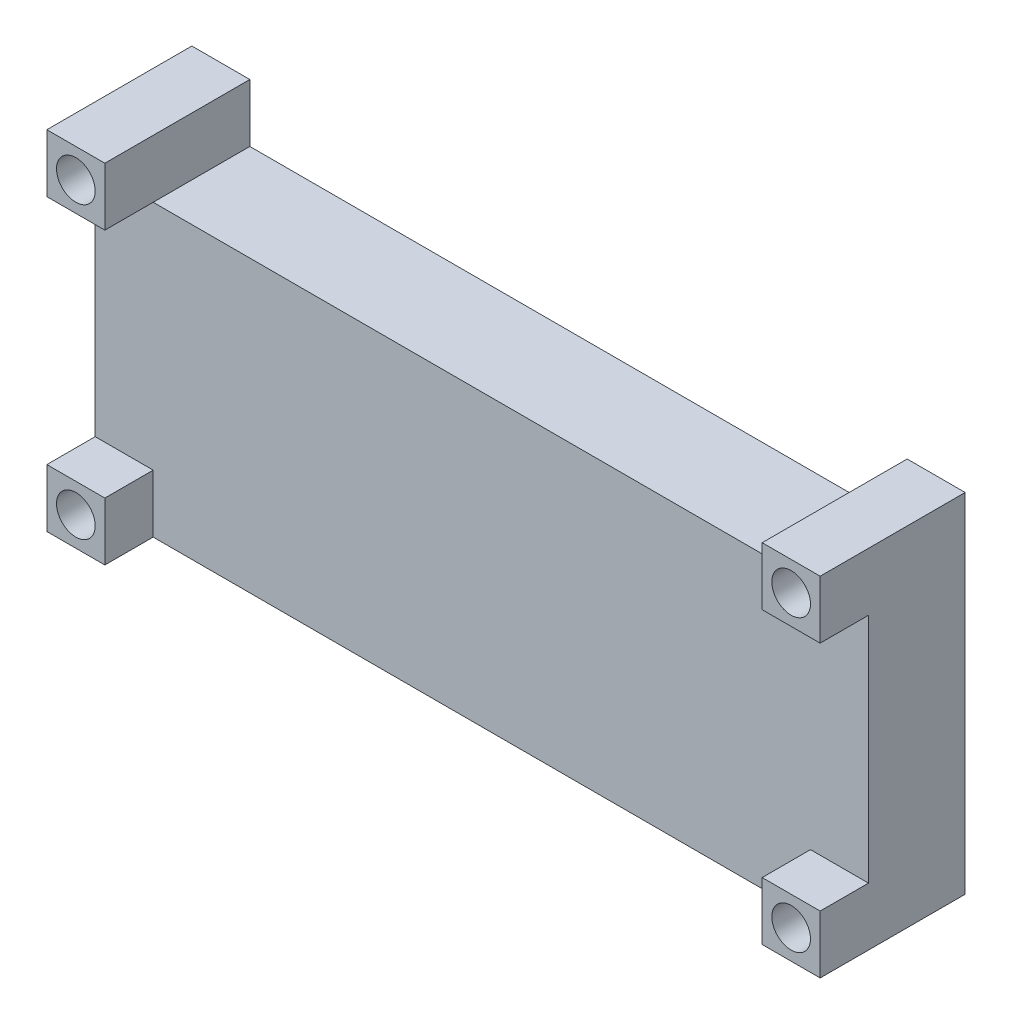
ISO-10303-21;
HEADER;
FILE_DESCRIPTION(('STEP AP214'),'2;1');
FILE_NAME('part.step','',(''),(''),'','','');
FILE_SCHEMA(('AUTOMOTIVE_DESIGN { 1 0 10303 214 1 1 1 1 }'));
ENDSEC;
DATA;
#1=APPLICATION_CONTEXT('core data for automotive mechanical design processes');
#2=APPLICATION_PROTOCOL_DEFINITION('international standard','automotive_design',2000,#1);
#3=PRODUCT_CONTEXT('',#1,'mechanical');
#4=PRODUCT('Part','Part','',(#3));
#5=PRODUCT_RELATED_PRODUCT_CATEGORY('part','',(#4));
#6=PRODUCT_DEFINITION_FORMATION('','',#4);
#7=PRODUCT_DEFINITION_CONTEXT('part definition',#1,'design');
#8=PRODUCT_DEFINITION('design','',#6,#7);
#9=PRODUCT_DEFINITION_SHAPE('','',#8);
#10=(LENGTH_UNIT() NAMED_UNIT(*) SI_UNIT(.MILLI.,.METRE.));
#11=(NAMED_UNIT(*) PLANE_ANGLE_UNIT() SI_UNIT($,.RADIAN.));
#12=(NAMED_UNIT(*) SI_UNIT($,.STERADIAN.) SOLID_ANGLE_UNIT());
#13=UNCERTAINTY_MEASURE_WITH_UNIT(LENGTH_MEASURE(1.E-05),#10,'distance_accuracy_value','');
#14=(GEOMETRIC_REPRESENTATION_CONTEXT(3) GLOBAL_UNCERTAINTY_ASSIGNED_CONTEXT((#13)) GLOBAL_UNIT_ASSIGNED_CONTEXT((#10,
#11,#12)) REPRESENTATION_CONTEXT('',''));
#15=CARTESIAN_POINT('',(0.,0.,0.));
#16=DIRECTION('',(0.,0.,1.));
#17=DIRECTION('',(1.,0.,0.));
#18=AXIS2_PLACEMENT_3D('',#15,#16,#17);
#19=CARTESIAN_POINT('',(0.,0.,10.));
#20=DIRECTION('',(1.,0.,0.));
#21=DIRECTION('',(0.,0.,-1.));
#22=AXIS2_PLACEMENT_3D('',#19,#20,#21);
#23=PLANE('',#22);
#24=DIRECTION('',(0.,-1.,0.));
#25=VECTOR('',#24,1.);
#26=CARTESIAN_POINT('',(0.,0.,0.));
#27=LINE('',#26,#25);
#28=CARTESIAN_POINT('',(0.,36.,0.));
#29=VERTEX_POINT('',#28);
#30=CARTESIAN_POINT('',(0.,0.,0.));
#31=VERTEX_POINT('',#30);
#32=EDGE_CURVE('E263',#29,#31,#27,.T.);
#33=ORIENTED_EDGE('',*,*,#32,.T.);
#34=DIRECTION('',(0.,0.,-1.));
#35=VECTOR('',#34,1.);
#36=CARTESIAN_POINT('',(0.,0.,10.));
#37=LINE('',#36,#35);
#38=CARTESIAN_POINT('',(0.,0.,15.));
#39=VERTEX_POINT('',#38);
#40=EDGE_CURVE('E11',#39,#31,#37,.T.);
#41=ORIENTED_EDGE('',*,*,#40,.F.);
#42=DIRECTION('',(0.,-1.,0.));
#43=VECTOR('',#42,1.);
#44=CARTESIAN_POINT('',(0.,6.,15.));
#45=LINE('',#44,#43);
#46=CARTESIAN_POINT('',(0.,6.,15.));
#47=VERTEX_POINT('',#46);
#48=EDGE_CURVE('E214',#47,#39,#45,.T.);
#49=ORIENTED_EDGE('',*,*,#48,.F.);
#50=DIRECTION('',(0.,0.,-1.));
#51=VECTOR('',#50,1.);
#52=CARTESIAN_POINT('',(0.,6.,15.));
#53=LINE('',#52,#51);
#54=CARTESIAN_POINT('',(0.,6.,10.));
#55=VERTEX_POINT('',#54);
#56=EDGE_CURVE('E224',#47,#55,#53,.T.);
#57=ORIENTED_EDGE('',*,*,#56,.T.);
#58=DIRECTION('',(0.,-1.,0.));
#59=VECTOR('',#58,1.);
#60=CARTESIAN_POINT('',(0.,0.,10.));
#61=LINE('',#60,#59);
#62=CARTESIAN_POINT('',(0.,30.,10.));
#63=VERTEX_POINT('',#62);
#64=EDGE_CURVE('E264',#63,#55,#61,.T.);
#65=ORIENTED_EDGE('',*,*,#64,.F.);
#66=DIRECTION('',(0.,0.,-1.));
#67=VECTOR('',#66,1.);
#68=CARTESIAN_POINT('',(0.,30.,15.));
#69=LINE('',#68,#67);
#70=CARTESIAN_POINT('',(0.,30.,15.));
#71=VERTEX_POINT('',#70);
#72=EDGE_CURVE('E260',#71,#63,#69,.T.);
#73=ORIENTED_EDGE('',*,*,#72,.F.);
#74=DIRECTION('',(0.,-1.,0.));
#75=VECTOR('',#74,1.);
#76=CARTESIAN_POINT('',(0.,36.,15.));
#77=LINE('',#76,#75);
#78=CARTESIAN_POINT('',(0.,36.,15.));
#79=VERTEX_POINT('',#78);
#80=EDGE_CURVE('E244',#79,#71,#77,.T.);
#81=ORIENTED_EDGE('',*,*,#80,.F.);
#82=DIRECTION('',(0.,0.,-1.));
#83=VECTOR('',#82,1.);
#84=CARTESIAN_POINT('',(0.,36.,10.));
#85=LINE('',#84,#83);
#86=EDGE_CURVE('E273',#79,#29,#85,.T.);
#87=ORIENTED_EDGE('',*,*,#86,.T.);
#88=EDGE_LOOP('',(#33,#41,#49,#57,#65,#73,#81,#87));
#89=FACE_BOUND('',#88,.T.);
#90=ADVANCED_FACE('F41',(#89),#23,.F.);
#91=CARTESIAN_POINT('',(0.,0.,10.));
#92=DIRECTION('',(0.,1.,0.));
#93=DIRECTION('',(0.,0.,1.));
#94=AXIS2_PLACEMENT_3D('',#91,#92,#93);
#95=PLANE('',#94);
#96=DIRECTION('',(1.,0.,0.));
#97=VECTOR('',#96,1.);
#98=CARTESIAN_POINT('',(0.,0.,0.));
#99=LINE('',#98,#97);
#100=CARTESIAN_POINT('',(80.,0.,0.));
#101=VERTEX_POINT('',#100);
#102=EDGE_CURVE('E276',#31,#101,#99,.T.);
#103=ORIENTED_EDGE('',*,*,#102,.T.);
#104=DIRECTION('',(0.,0.,-1.));
#105=VECTOR('',#104,1.);
#106=CARTESIAN_POINT('',(80.,0.,10.));
#107=LINE('',#106,#105);
#108=CARTESIAN_POINT('',(80.,0.,15.));
#109=VERTEX_POINT('',#108);
#110=EDGE_CURVE('E48',#109,#101,#107,.T.);
#111=ORIENTED_EDGE('',*,*,#110,.F.);
#112=DIRECTION('',(1.,0.,0.));
#113=VECTOR('',#112,1.);
#114=CARTESIAN_POINT('',(74.,0.,15.));
#115=LINE('',#114,#113);
#116=CARTESIAN_POINT('',(74.,0.,15.));
#117=VERTEX_POINT('',#116);
#118=EDGE_CURVE('E157',#117,#109,#115,.T.);
#119=ORIENTED_EDGE('',*,*,#118,.F.);
#120=DIRECTION('',(0.,0.,-1.));
#121=VECTOR('',#120,1.);
#122=CARTESIAN_POINT('',(74.,0.,15.));
#123=LINE('',#122,#121);
#124=CARTESIAN_POINT('',(74.,0.,10.));
#125=VERTEX_POINT('',#124);
#126=EDGE_CURVE('E161',#117,#125,#123,.T.);
#127=ORIENTED_EDGE('',*,*,#126,.T.);
#128=DIRECTION('',(1.,0.,0.));
#129=VECTOR('',#128,1.);
#130=CARTESIAN_POINT('',(0.,0.,10.));
#131=LINE('',#130,#129);
#132=CARTESIAN_POINT('',(6.,0.,10.));
#133=VERTEX_POINT('',#132);
#134=EDGE_CURVE('E61',#133,#125,#131,.T.);
#135=ORIENTED_EDGE('',*,*,#134,.F.);
#136=DIRECTION('',(0.,0.,-1.));
#137=VECTOR('',#136,1.);
#138=CARTESIAN_POINT('',(6.,0.,15.));
#139=LINE('',#138,#137);
#140=CARTESIAN_POINT('',(6.,0.,15.));
#141=VERTEX_POINT('',#140);
#142=EDGE_CURVE('E234',#141,#133,#139,.T.);
#143=ORIENTED_EDGE('',*,*,#142,.F.);
#144=DIRECTION('',(1.,0.,0.));
#145=VECTOR('',#144,1.);
#146=CARTESIAN_POINT('',(0.,0.,15.));
#147=LINE('',#146,#145);
#148=EDGE_CURVE('E217',#39,#141,#147,.T.);
#149=ORIENTED_EDGE('',*,*,#148,.F.);
#150=ORIENTED_EDGE('',*,*,#40,.T.);
#151=EDGE_LOOP('',(#103,#111,#119,#127,#135,#143,#149,#150));
#152=FACE_BOUND('',#151,.T.);
#153=ADVANCED_FACE('F159',(#152),#95,.F.);
#154=CARTESIAN_POINT('',(80.,0.,10.));
#155=DIRECTION('',(-1.,0.,0.));
#156=DIRECTION('',(0.,0.,1.));
#157=AXIS2_PLACEMENT_3D('',#154,#155,#156);
#158=PLANE('',#157);
#159=DIRECTION('',(0.,1.,0.));
#160=VECTOR('',#159,1.);
#161=CARTESIAN_POINT('',(80.,0.,0.));
#162=LINE('',#161,#160);
#163=CARTESIAN_POINT('',(80.,36.,0.));
#164=VERTEX_POINT('',#163);
#165=EDGE_CURVE('E278',#101,#164,#162,.T.);
#166=ORIENTED_EDGE('',*,*,#165,.T.);
#167=DIRECTION('',(0.,0.,-1.));
#168=VECTOR('',#167,1.);
#169=CARTESIAN_POINT('',(80.,36.,10.));
#170=LINE('',#169,#168);
#171=CARTESIAN_POINT('',(80.,36.,15.));
#172=VERTEX_POINT('',#171);
#173=EDGE_CURVE('E303',#172,#164,#170,.T.);
#174=ORIENTED_EDGE('',*,*,#173,.F.);
#175=DIRECTION('',(0.,1.,0.));
#176=VECTOR('',#175,1.);
#177=CARTESIAN_POINT('',(80.,36.,15.));
#178=LINE('',#177,#176);
#179=CARTESIAN_POINT('',(80.,30.,15.));
#180=VERTEX_POINT('',#179);
#181=EDGE_CURVE('E196',#180,#172,#178,.T.);
#182=ORIENTED_EDGE('',*,*,#181,.F.);
#183=DIRECTION('',(0.,0.,-1.));
#184=VECTOR('',#183,1.);
#185=CARTESIAN_POINT('',(80.,30.,15.));
#186=LINE('',#185,#184);
#187=CARTESIAN_POINT('',(80.,30.,10.));
#188=VERTEX_POINT('',#187);
#189=EDGE_CURVE('E202',#180,#188,#186,.T.);
#190=ORIENTED_EDGE('',*,*,#189,.T.);
#191=DIRECTION('',(0.,1.,0.));
#192=VECTOR('',#191,1.);
#193=CARTESIAN_POINT('',(80.,0.,10.));
#194=LINE('',#193,#192);
#195=CARTESIAN_POINT('',(80.,6.,10.));
#196=VERTEX_POINT('',#195);
#197=EDGE_CURVE('E268',#196,#188,#194,.T.);
#198=ORIENTED_EDGE('',*,*,#197,.F.);
#199=DIRECTION('',(0.,0.,-1.));
#200=VECTOR('',#199,1.);
#201=CARTESIAN_POINT('',(80.,6.,15.));
#202=LINE('',#201,#200);
#203=CARTESIAN_POINT('',(80.,6.,15.));
#204=VERTEX_POINT('',#203);
#205=EDGE_CURVE('E181',#204,#196,#202,.T.);
#206=ORIENTED_EDGE('',*,*,#205,.F.);
#207=DIRECTION('',(0.,1.,0.));
#208=VECTOR('',#207,1.);
#209=CARTESIAN_POINT('',(80.,6.,15.));
#210=LINE('',#209,#208);
#211=EDGE_CURVE('E166',#109,#204,#210,.T.);
#212=ORIENTED_EDGE('',*,*,#211,.F.);
#213=ORIENTED_EDGE('',*,*,#110,.T.);
#214=EDGE_LOOP('',(#166,#174,#182,#190,#198,#206,#212,#213));
#215=FACE_BOUND('',#214,.T.);
#216=ADVANCED_FACE('F307',(#215),#158,.F.);
#217=CARTESIAN_POINT('',(74.,36.,10.));
#218=DIRECTION('',(0.,-1.,0.));
#219=DIRECTION('',(0.,0.,-1.));
#220=AXIS2_PLACEMENT_3D('',#217,#218,#219);
#221=PLANE('',#220);
#222=DIRECTION('',(-1.,0.,0.));
#223=VECTOR('',#222,1.);
#224=CARTESIAN_POINT('',(74.,36.,0.));
#225=LINE('',#224,#223);
#226=CARTESIAN_POINT('',(74.,36.,0.));
#227=VERTEX_POINT('',#226);
#228=EDGE_CURVE('E280',#164,#227,#225,.T.);
#229=ORIENTED_EDGE('',*,*,#228,.T.);
#230=DIRECTION('',(0.,0.,-1.));
#231=VECTOR('',#230,1.);
#232=CARTESIAN_POINT('',(74.,36.,10.));
#233=LINE('',#232,#231);
#234=CARTESIAN_POINT('',(74.,36.,15.));
#235=VERTEX_POINT('',#234);
#236=EDGE_CURVE('E300',#235,#227,#233,.T.);
#237=ORIENTED_EDGE('',*,*,#236,.F.);
#238=DIRECTION('',(-1.,0.,0.));
#239=VECTOR('',#238,1.);
#240=CARTESIAN_POINT('',(74.,36.,15.));
#241=LINE('',#240,#239);
#242=EDGE_CURVE('E199',#172,#235,#241,.T.);
#243=ORIENTED_EDGE('',*,*,#242,.F.);
#244=ORIENTED_EDGE('',*,*,#173,.T.);
#245=EDGE_LOOP('',(#229,#237,#243,#244));
#246=FACE_BOUND('',#245,.T.);
#247=ADVANCED_FACE('F316',(#246),#221,.F.);
#248=CARTESIAN_POINT('',(74.,30.,10.));
#249=DIRECTION('',(1.,0.,0.));
#250=DIRECTION('',(0.,0.,-1.));
#251=AXIS2_PLACEMENT_3D('',#248,#249,#250);
#252=PLANE('',#251);
#253=DIRECTION('',(0.,-1.,0.));
#254=VECTOR('',#253,1.);
#255=CARTESIAN_POINT('',(74.,30.,0.));
#256=LINE('',#255,#254);
#257=CARTESIAN_POINT('',(74.,30.,0.));
#258=VERTEX_POINT('',#257);
#259=EDGE_CURVE('E282',#227,#258,#256,.T.);
#260=ORIENTED_EDGE('',*,*,#259,.T.);
#261=DIRECTION('',(0.,0.,-1.));
#262=VECTOR('',#261,1.);
#263=CARTESIAN_POINT('',(74.,30.,10.));
#264=LINE('',#263,#262);
#265=CARTESIAN_POINT('',(74.,30.,10.));
#266=VERTEX_POINT('',#265);
#267=EDGE_CURVE('E297',#266,#258,#264,.T.);
#268=ORIENTED_EDGE('',*,*,#267,.F.);
#269=DIRECTION('',(0.,0.,-1.));
#270=VECTOR('',#269,1.);
#271=CARTESIAN_POINT('',(74.,30.,15.));
#272=LINE('',#271,#270);
#273=CARTESIAN_POINT('',(74.,30.,15.));
#274=VERTEX_POINT('',#273);
#275=EDGE_CURVE('E207',#274,#266,#272,.T.);
#276=ORIENTED_EDGE('',*,*,#275,.F.);
#277=DIRECTION('',(0.,-1.,0.));
#278=VECTOR('',#277,1.);
#279=CARTESIAN_POINT('',(74.,36.,15.));
#280=LINE('',#279,#278);
#281=EDGE_CURVE('E191',#235,#274,#280,.T.);
#282=ORIENTED_EDGE('',*,*,#281,.F.);
#283=ORIENTED_EDGE('',*,*,#236,.T.);
#284=EDGE_LOOP('',(#260,#268,#276,#282,#283));
#285=FACE_BOUND('',#284,.T.);
#286=ADVANCED_FACE('F320',(#285),#252,.F.);
#287=CARTESIAN_POINT('',(6.,30.,10.));
#288=DIRECTION('',(0.,-1.,0.));
#289=DIRECTION('',(0.,0.,-1.));
#290=AXIS2_PLACEMENT_3D('',#287,#288,#289);
#291=PLANE('',#290);
#292=DIRECTION('',(-1.,0.,0.));
#293=VECTOR('',#292,1.);
#294=CARTESIAN_POINT('',(6.,30.,0.));
#295=LINE('',#294,#293);
#296=CARTESIAN_POINT('',(6.,30.,0.));
#297=VERTEX_POINT('',#296);
#298=EDGE_CURVE('E284',#258,#297,#295,.T.);
#299=ORIENTED_EDGE('',*,*,#298,.T.);
#300=DIRECTION('',(0.,0.,-1.));
#301=VECTOR('',#300,1.);
#302=CARTESIAN_POINT('',(6.,30.,10.));
#303=LINE('',#302,#301);
#304=CARTESIAN_POINT('',(6.,30.,10.));
#305=VERTEX_POINT('',#304);
#306=EDGE_CURVE('E294',#305,#297,#303,.T.);
#307=ORIENTED_EDGE('',*,*,#306,.F.);
#308=DIRECTION('',(-1.,0.,0.));
#309=VECTOR('',#308,1.);
#310=CARTESIAN_POINT('',(6.,30.,10.));
#311=LINE('',#310,#309);
#312=EDGE_CURVE('E270',#266,#305,#311,.T.);
#313=ORIENTED_EDGE('',*,*,#312,.F.);
#314=ORIENTED_EDGE('',*,*,#267,.T.);
#315=EDGE_LOOP('',(#299,#307,#313,#314));
#316=FACE_BOUND('',#315,.T.);
#317=ADVANCED_FACE('F333',(#316),#291,.F.);
#318=CARTESIAN_POINT('',(6.,36.,10.));
#319=DIRECTION('',(-1.,0.,0.));
#320=DIRECTION('',(0.,0.,1.));
#321=AXIS2_PLACEMENT_3D('',#318,#319,#320);
#322=PLANE('',#321);
#323=DIRECTION('',(0.,1.,0.));
#324=VECTOR('',#323,1.);
#325=CARTESIAN_POINT('',(6.,36.,0.));
#326=LINE('',#325,#324);
#327=CARTESIAN_POINT('',(6.,36.,0.));
#328=VERTEX_POINT('',#327);
#329=EDGE_CURVE('E286',#297,#328,#326,.T.);
#330=ORIENTED_EDGE('',*,*,#329,.T.);
#331=DIRECTION('',(0.,0.,-1.));
#332=VECTOR('',#331,1.);
#333=CARTESIAN_POINT('',(6.,36.,10.));
#334=LINE('',#333,#332);
#335=CARTESIAN_POINT('',(6.,36.,15.));
#336=VERTEX_POINT('',#335);
#337=EDGE_CURVE('E291',#336,#328,#334,.T.);
#338=ORIENTED_EDGE('',*,*,#337,.F.);
#339=DIRECTION('',(0.,1.,0.));
#340=VECTOR('',#339,1.);
#341=CARTESIAN_POINT('',(6.,36.,15.));
#342=LINE('',#341,#340);
#343=CARTESIAN_POINT('',(6.,30.,15.));
#344=VERTEX_POINT('',#343);
#345=EDGE_CURVE('E249',#344,#336,#342,.T.);
#346=ORIENTED_EDGE('',*,*,#345,.F.);
#347=DIRECTION('',(0.,0.,-1.));
#348=VECTOR('',#347,1.);
#349=CARTESIAN_POINT('',(6.,30.,15.));
#350=LINE('',#349,#348);
#351=EDGE_CURVE('E255',#344,#305,#350,.T.);
#352=ORIENTED_EDGE('',*,*,#351,.T.);
#353=ORIENTED_EDGE('',*,*,#306,.T.);
#354=EDGE_LOOP('',(#330,#338,#346,#352,#353));
#355=FACE_BOUND('',#354,.T.);
#356=ADVANCED_FACE('F336',(#355),#322,.F.);
#357=CARTESIAN_POINT('',(0.,36.,10.));
#358=DIRECTION('',(0.,-1.,0.));
#359=DIRECTION('',(0.,0.,-1.));
#360=AXIS2_PLACEMENT_3D('',#357,#358,#359);
#361=PLANE('',#360);
#362=DIRECTION('',(-1.,0.,0.));
#363=VECTOR('',#362,1.);
#364=CARTESIAN_POINT('',(0.,36.,0.));
#365=LINE('',#364,#363);
#366=EDGE_CURVE('E266',#328,#29,#365,.T.);
#367=ORIENTED_EDGE('',*,*,#366,.T.);
#368=ORIENTED_EDGE('',*,*,#86,.F.);
#369=DIRECTION('',(-1.,0.,0.));
#370=VECTOR('',#369,1.);
#371=CARTESIAN_POINT('',(0.,36.,15.));
#372=LINE('',#371,#370);
#373=EDGE_CURVE('E252',#336,#79,#372,.T.);
#374=ORIENTED_EDGE('',*,*,#373,.F.);
#375=ORIENTED_EDGE('',*,*,#337,.T.);
#376=EDGE_LOOP('',(#367,#368,#374,#375));
#377=FACE_BOUND('',#376,.T.);
#378=ADVANCED_FACE('F341',(#377),#361,.F.);
#379=CARTESIAN_POINT('',(0.,0.,10.));
#380=DIRECTION('',(0.,0.,-1.));
#381=DIRECTION('',(-1.,0.,0.));
#382=AXIS2_PLACEMENT_3D('',#379,#380,#381);
#383=PLANE('',#382);
#384=DIRECTION('',(0.,-1.,0.));
#385=VECTOR('',#384,1.);
#386=CARTESIAN_POINT('',(74.,6.,10.));
#387=LINE('',#386,#385);
#388=CARTESIAN_POINT('',(74.,6.,10.));
#389=VERTEX_POINT('',#388);
#390=EDGE_CURVE('E179',#389,#125,#387,.T.);
#391=ORIENTED_EDGE('',*,*,#390,.F.);
#392=DIRECTION('',(-1.,0.,0.));
#393=VECTOR('',#392,1.);
#394=CARTESIAN_POINT('',(74.,6.,10.));
#395=LINE('',#394,#393);
#396=EDGE_CURVE('E55',#196,#389,#395,.T.);
#397=ORIENTED_EDGE('',*,*,#396,.F.);
#398=ORIENTED_EDGE('',*,*,#197,.T.);
#399=DIRECTION('',(1.,0.,0.));
#400=VECTOR('',#399,1.);
#401=CARTESIAN_POINT('',(74.,30.,10.));
#402=LINE('',#401,#400);
#403=EDGE_CURVE('E184',#266,#188,#402,.T.);
#404=ORIENTED_EDGE('',*,*,#403,.F.);
#405=ORIENTED_EDGE('',*,*,#312,.T.);
#406=DIRECTION('',(1.,0.,0.));
#407=VECTOR('',#406,1.);
#408=CARTESIAN_POINT('',(0.,30.,10.));
#409=LINE('',#408,#407);
#410=EDGE_CURVE('E243',#63,#305,#409,.T.);
#411=ORIENTED_EDGE('',*,*,#410,.F.);
#412=ORIENTED_EDGE('',*,*,#64,.T.);
#413=DIRECTION('',(-1.,0.,0.));
#414=VECTOR('',#413,1.);
#415=CARTESIAN_POINT('',(0.,6.,10.));
#416=LINE('',#415,#414);
#417=CARTESIAN_POINT('',(6.,6.,10.));
#418=VERTEX_POINT('',#417);
#419=EDGE_CURVE('E218',#418,#55,#416,.T.);
#420=ORIENTED_EDGE('',*,*,#419,.F.);
#421=DIRECTION('',(0.,1.,0.));
#422=VECTOR('',#421,1.);
#423=CARTESIAN_POINT('',(6.,6.,10.));
#424=LINE('',#423,#422);
#425=EDGE_CURVE('E213',#133,#418,#424,.T.);
#426=ORIENTED_EDGE('',*,*,#425,.F.);
#427=ORIENTED_EDGE('',*,*,#134,.T.);
#428=EDGE_LOOP('',(#391,#397,#398,#404,#405,#411,#412,#420,#426,#427));
#429=FACE_BOUND('',#428,.T.);
#430=ADVANCED_FACE('F330',(#429),#383,.F.);
#431=CARTESIAN_POINT('',(0.,0.,0.));
#432=DIRECTION('',(0.,0.,-1.));
#433=DIRECTION('',(-1.,0.,0.));
#434=AXIS2_PLACEMENT_3D('',#431,#432,#433);
#435=PLANE('',#434);
#436=CARTESIAN_POINT('',(3.,3.,0.));
#437=DIRECTION('',(0.,0.,1.));
#438=DIRECTION('',(1.,0.,0.));
#439=AXIS2_PLACEMENT_3D('',#436,#437,#438);
#440=CIRCLE('',#439,2.);
#441=CARTESIAN_POINT('',(5.,3.,0.));
#442=VERTEX_POINT('',#441);
#443=EDGE_CURVE('E377',#442,#442,#440,.T.);
#444=ORIENTED_EDGE('',*,*,#443,.T.);
#445=EDGE_LOOP('',(#444));
#446=FACE_BOUND('',#445,.T.);
#447=CARTESIAN_POINT('',(77.,33.,0.));
#448=DIRECTION('',(0.,0.,1.));
#449=DIRECTION('',(1.,0.,0.));
#450=AXIS2_PLACEMENT_3D('',#447,#448,#449);
#451=CIRCLE('',#450,2.);
#452=CARTESIAN_POINT('',(79.,33.,0.));
#453=VERTEX_POINT('',#452);
#454=EDGE_CURVE('E380',#453,#453,#451,.T.);
#455=ORIENTED_EDGE('',*,*,#454,.T.);
#456=EDGE_LOOP('',(#455));
#457=FACE_BOUND('',#456,.T.);
#458=CARTESIAN_POINT('',(77.,3.,0.));
#459=DIRECTION('',(0.,0.,1.));
#460=DIRECTION('',(1.,0.,0.));
#461=AXIS2_PLACEMENT_3D('',#458,#459,#460);
#462=CIRCLE('',#461,2.);
#463=CARTESIAN_POINT('',(79.,3.,0.));
#464=VERTEX_POINT('',#463);
#465=EDGE_CURVE('E385',#464,#464,#462,.T.);
#466=ORIENTED_EDGE('',*,*,#465,.T.);
#467=EDGE_LOOP('',(#466));
#468=FACE_BOUND('',#467,.T.);
#469=CARTESIAN_POINT('',(3.,33.,0.));
#470=DIRECTION('',(0.,0.,1.));
#471=DIRECTION('',(1.,0.,0.));
#472=AXIS2_PLACEMENT_3D('',#469,#470,#471);
#473=CIRCLE('',#472,2.);
#474=CARTESIAN_POINT('',(5.,33.,0.));
#475=VERTEX_POINT('',#474);
#476=EDGE_CURVE('E237',#475,#475,#473,.T.);
#477=ORIENTED_EDGE('',*,*,#476,.T.);
#478=EDGE_LOOP('',(#477));
#479=FACE_BOUND('',#478,.T.);
#480=ORIENTED_EDGE('',*,*,#32,.F.);
#481=ORIENTED_EDGE('',*,*,#366,.F.);
#482=ORIENTED_EDGE('',*,*,#329,.F.);
#483=ORIENTED_EDGE('',*,*,#298,.F.);
#484=ORIENTED_EDGE('',*,*,#259,.F.);
#485=ORIENTED_EDGE('',*,*,#228,.F.);
#486=ORIENTED_EDGE('',*,*,#165,.F.);
#487=ORIENTED_EDGE('',*,*,#102,.F.);
#488=EDGE_LOOP('',(#480,#481,#482,#483,#484,#485,#486,#487));
#489=FACE_BOUND('',#488,.T.);
#490=ADVANCED_FACE('F312',(#446,#457,#468,#479,#489),#435,.T.);
#491=CARTESIAN_POINT('',(0.,0.,15.));
#492=DIRECTION('',(0.,0.,1.));
#493=DIRECTION('',(1.,0.,0.));
#494=AXIS2_PLACEMENT_3D('',#491,#492,#493);
#495=PLANE('',#494);
#496=ORIENTED_EDGE('',*,*,#80,.T.);
#497=DIRECTION('',(1.,0.,0.));
#498=VECTOR('',#497,1.);
#499=CARTESIAN_POINT('',(0.,30.,15.));
#500=LINE('',#499,#498);
#501=EDGE_CURVE('E247',#71,#344,#500,.T.);
#502=ORIENTED_EDGE('',*,*,#501,.T.);
#503=ORIENTED_EDGE('',*,*,#345,.T.);
#504=ORIENTED_EDGE('',*,*,#373,.T.);
#505=EDGE_LOOP('',(#496,#502,#503,#504));
#506=FACE_BOUND('',#505,.T.);
#507=CARTESIAN_POINT('',(3.,33.,15.));
#508=DIRECTION('',(0.,0.,1.));
#509=DIRECTION('',(1.,0.,0.));
#510=AXIS2_PLACEMENT_3D('',#507,#508,#509);
#511=CIRCLE('',#510,2.);
#512=CARTESIAN_POINT('',(5.,33.,15.));
#513=VERTEX_POINT('',#512);
#514=EDGE_CURVE('E240',#513,#513,#511,.T.);
#515=ORIENTED_EDGE('',*,*,#514,.F.);
#516=EDGE_LOOP('',(#515));
#517=FACE_BOUND('',#516,.T.);
#518=ADVANCED_FACE('F348',(#506,#517),#495,.T.);
#519=CARTESIAN_POINT('',(0.,30.,15.));
#520=DIRECTION('',(0.,1.,0.));
#521=DIRECTION('',(0.,0.,1.));
#522=AXIS2_PLACEMENT_3D('',#519,#520,#521);
#523=PLANE('',#522);
#524=ORIENTED_EDGE('',*,*,#410,.T.);
#525=ORIENTED_EDGE('',*,*,#351,.F.);
#526=ORIENTED_EDGE('',*,*,#501,.F.);
#527=ORIENTED_EDGE('',*,*,#72,.T.);
#528=EDGE_LOOP('',(#524,#525,#526,#527));
#529=FACE_BOUND('',#528,.T.);
#530=ADVANCED_FACE('F351',(#529),#523,.F.);
#531=CARTESIAN_POINT('',(3.,33.,15.));
#532=DIRECTION('',(0.,0.,-1.));
#533=DIRECTION('',(-1.,0.,0.));
#534=AXIS2_PLACEMENT_3D('',#531,#532,#533);
#535=CYLINDRICAL_SURFACE('',#534,2.);
#536=ORIENTED_EDGE('',*,*,#514,.T.);
#537=EDGE_LOOP('',(#536));
#538=FACE_BOUND('',#537,.T.);
#539=ORIENTED_EDGE('',*,*,#476,.F.);
#540=EDGE_LOOP('',(#539));
#541=FACE_BOUND('',#540,.T.);
#542=ADVANCED_FACE('F367',(#538,#541),#535,.F.);
#543=CARTESIAN_POINT('',(0.,-30.,15.));
#544=DIRECTION('',(0.,0.,1.));
#545=DIRECTION('',(1.,0.,0.));
#546=AXIS2_PLACEMENT_3D('',#543,#544,#545);
#547=PLANE('',#546);
#548=ORIENTED_EDGE('',*,*,#48,.T.);
#549=ORIENTED_EDGE('',*,*,#148,.T.);
#550=DIRECTION('',(0.,1.,0.));
#551=VECTOR('',#550,1.);
#552=CARTESIAN_POINT('',(6.,6.,15.));
#553=LINE('',#552,#551);
#554=CARTESIAN_POINT('',(6.,6.,15.));
#555=VERTEX_POINT('',#554);
#556=EDGE_CURVE('E220',#141,#555,#553,.T.);
#557=ORIENTED_EDGE('',*,*,#556,.T.);
#558=DIRECTION('',(-1.,0.,0.));
#559=VECTOR('',#558,1.);
#560=CARTESIAN_POINT('',(0.,6.,15.));
#561=LINE('',#560,#559);
#562=EDGE_CURVE('E222',#555,#47,#561,.T.);
#563=ORIENTED_EDGE('',*,*,#562,.T.);
#564=EDGE_LOOP('',(#548,#549,#557,#563));
#565=FACE_BOUND('',#564,.T.);
#566=CARTESIAN_POINT('',(3.,3.,15.));
#567=DIRECTION('',(0.,0.,1.));
#568=DIRECTION('',(1.,0.,0.));
#569=AXIS2_PLACEMENT_3D('',#566,#567,#568);
#570=CIRCLE('',#569,2.);
#571=CARTESIAN_POINT('',(5.,3.,15.));
#572=VERTEX_POINT('',#571);
#573=EDGE_CURVE('E210',#572,#572,#570,.T.);
#574=ORIENTED_EDGE('',*,*,#573,.F.);
#575=EDGE_LOOP('',(#574));
#576=FACE_BOUND('',#575,.T.);
#577=ADVANCED_FACE('F364',(#565,#576),#547,.T.);
#578=CARTESIAN_POINT('',(6.,6.,15.));
#579=DIRECTION('',(-1.,0.,0.));
#580=DIRECTION('',(0.,0.,1.));
#581=AXIS2_PLACEMENT_3D('',#578,#579,#580);
#582=PLANE('',#581);
#583=ORIENTED_EDGE('',*,*,#425,.T.);
#584=DIRECTION('',(0.,0.,-1.));
#585=VECTOR('',#584,1.);
#586=CARTESIAN_POINT('',(6.,6.,15.));
#587=LINE('',#586,#585);
#588=EDGE_CURVE('E231',#555,#418,#587,.T.);
#589=ORIENTED_EDGE('',*,*,#588,.F.);
#590=ORIENTED_EDGE('',*,*,#556,.F.);
#591=ORIENTED_EDGE('',*,*,#142,.T.);
#592=EDGE_LOOP('',(#583,#589,#590,#591));
#593=FACE_BOUND('',#592,.T.);
#594=ADVANCED_FACE('F359',(#593),#582,.F.);
#595=CARTESIAN_POINT('',(0.,6.,15.));
#596=DIRECTION('',(0.,-1.,0.));
#597=DIRECTION('',(0.,0.,-1.));
#598=AXIS2_PLACEMENT_3D('',#595,#596,#597);
#599=PLANE('',#598);
#600=ORIENTED_EDGE('',*,*,#419,.T.);
#601=ORIENTED_EDGE('',*,*,#56,.F.);
#602=ORIENTED_EDGE('',*,*,#562,.F.);
#603=ORIENTED_EDGE('',*,*,#588,.T.);
#604=EDGE_LOOP('',(#600,#601,#602,#603));
#605=FACE_BOUND('',#604,.T.);
#606=ADVANCED_FACE('F356',(#605),#599,.F.);
#607=CARTESIAN_POINT('',(3.,3.,15.));
#608=DIRECTION('',(0.,0.,-1.));
#609=DIRECTION('',(-1.,0.,0.));
#610=AXIS2_PLACEMENT_3D('',#607,#608,#609);
#611=CYLINDRICAL_SURFACE('',#610,2.);
#612=ORIENTED_EDGE('',*,*,#573,.T.);
#613=EDGE_LOOP('',(#612));
#614=FACE_BOUND('',#613,.T.);
#615=ORIENTED_EDGE('',*,*,#443,.F.);
#616=EDGE_LOOP('',(#615));
#617=FACE_BOUND('',#616,.T.);
#618=ADVANCED_FACE('F371',(#614,#617),#611,.F.);
#619=CARTESIAN_POINT('',(74.,0.,15.));
#620=DIRECTION('',(0.,0.,1.));
#621=DIRECTION('',(1.,0.,0.));
#622=AXIS2_PLACEMENT_3D('',#619,#620,#621);
#623=PLANE('',#622);
#624=ORIENTED_EDGE('',*,*,#281,.T.);
#625=DIRECTION('',(1.,0.,0.));
#626=VECTOR('',#625,1.);
#627=CARTESIAN_POINT('',(74.,30.,15.));
#628=LINE('',#627,#626);
#629=EDGE_CURVE('E194',#274,#180,#628,.T.);
#630=ORIENTED_EDGE('',*,*,#629,.T.);
#631=ORIENTED_EDGE('',*,*,#181,.T.);
#632=ORIENTED_EDGE('',*,*,#242,.T.);
#633=EDGE_LOOP('',(#624,#630,#631,#632));
#634=FACE_BOUND('',#633,.T.);
#635=CARTESIAN_POINT('',(77.,33.,15.));
#636=DIRECTION('',(0.,0.,1.));
#637=DIRECTION('',(1.,0.,0.));
#638=AXIS2_PLACEMENT_3D('',#635,#636,#637);
#639=CIRCLE('',#638,2.);
#640=CARTESIAN_POINT('',(79.,33.,15.));
#641=VERTEX_POINT('',#640);
#642=EDGE_CURVE('E180',#641,#641,#639,.T.);
#643=ORIENTED_EDGE('',*,*,#642,.F.);
#644=EDGE_LOOP('',(#643));
#645=FACE_BOUND('',#644,.T.);
#646=ADVANCED_FACE('F324',(#634,#645),#623,.T.);
#647=CARTESIAN_POINT('',(74.,30.,15.));
#648=DIRECTION('',(0.,1.,0.));
#649=DIRECTION('',(0.,0.,1.));
#650=AXIS2_PLACEMENT_3D('',#647,#648,#649);
#651=PLANE('',#650);
#652=ORIENTED_EDGE('',*,*,#403,.T.);
#653=ORIENTED_EDGE('',*,*,#189,.F.);
#654=ORIENTED_EDGE('',*,*,#629,.F.);
#655=ORIENTED_EDGE('',*,*,#275,.T.);
#656=EDGE_LOOP('',(#652,#653,#654,#655));
#657=FACE_BOUND('',#656,.T.);
#658=ADVANCED_FACE('F329',(#657),#651,.F.);
#659=CARTESIAN_POINT('',(77.,33.,15.));
#660=DIRECTION('',(0.,0.,-1.));
#661=DIRECTION('',(-1.,0.,0.));
#662=AXIS2_PLACEMENT_3D('',#659,#660,#661);
#663=CYLINDRICAL_SURFACE('',#662,2.);
#664=ORIENTED_EDGE('',*,*,#642,.T.);
#665=EDGE_LOOP('',(#664));
#666=FACE_BOUND('',#665,.T.);
#667=ORIENTED_EDGE('',*,*,#454,.F.);
#668=EDGE_LOOP('',(#667));
#669=FACE_BOUND('',#668,.T.);
#670=ADVANCED_FACE('F442',(#666,#669),#663,.F.);
#671=CARTESIAN_POINT('',(74.,-30.,15.));
#672=DIRECTION('',(0.,0.,1.));
#673=DIRECTION('',(1.,0.,0.));
#674=AXIS2_PLACEMENT_3D('',#671,#672,#673);
#675=PLANE('',#674);
#676=DIRECTION('',(0.,-1.,0.));
#677=VECTOR('',#676,1.);
#678=CARTESIAN_POINT('',(74.,6.,15.));
#679=LINE('',#678,#677);
#680=CARTESIAN_POINT('',(74.,6.,15.));
#681=VERTEX_POINT('',#680);
#682=EDGE_CURVE('E167',#681,#117,#679,.T.);
#683=ORIENTED_EDGE('',*,*,#682,.T.);
#684=ORIENTED_EDGE('',*,*,#118,.T.);
#685=ORIENTED_EDGE('',*,*,#211,.T.);
#686=DIRECTION('',(-1.,0.,0.));
#687=VECTOR('',#686,1.);
#688=CARTESIAN_POINT('',(74.,6.,15.));
#689=LINE('',#688,#687);
#690=EDGE_CURVE('E173',#204,#681,#689,.T.);
#691=ORIENTED_EDGE('',*,*,#690,.T.);
#692=EDGE_LOOP('',(#683,#684,#685,#691));
#693=FACE_BOUND('',#692,.T.);
#694=CARTESIAN_POINT('',(77.,3.,15.));
#695=DIRECTION('',(0.,0.,1.));
#696=DIRECTION('',(1.,0.,0.));
#697=AXIS2_PLACEMENT_3D('',#694,#695,#696);
#698=CIRCLE('',#697,2.);
#699=CARTESIAN_POINT('',(79.,3.,15.));
#700=VERTEX_POINT('',#699);
#701=EDGE_CURVE('E379',#700,#700,#698,.T.);
#702=ORIENTED_EDGE('',*,*,#701,.F.);
#703=EDGE_LOOP('',(#702));
#704=FACE_BOUND('',#703,.T.);
#705=ADVANCED_FACE('F170',(#693,#704),#675,.T.);
#706=CARTESIAN_POINT('',(74.,6.,15.));
#707=DIRECTION('',(1.,0.,0.));
#708=DIRECTION('',(0.,0.,-1.));
#709=AXIS2_PLACEMENT_3D('',#706,#707,#708);
#710=PLANE('',#709);
#711=ORIENTED_EDGE('',*,*,#390,.T.);
#712=ORIENTED_EDGE('',*,*,#126,.F.);
#713=ORIENTED_EDGE('',*,*,#682,.F.);
#714=DIRECTION('',(0.,0.,-1.));
#715=VECTOR('',#714,1.);
#716=CARTESIAN_POINT('',(74.,6.,15.));
#717=LINE('',#716,#715);
#718=EDGE_CURVE('E187',#681,#389,#717,.T.);
#719=ORIENTED_EDGE('',*,*,#718,.T.);
#720=EDGE_LOOP('',(#711,#712,#713,#719));
#721=FACE_BOUND('',#720,.T.);
#722=ADVANCED_FACE('F178',(#721),#710,.F.);
#723=CARTESIAN_POINT('',(74.,6.,15.));
#724=DIRECTION('',(0.,-1.,0.));
#725=DIRECTION('',(0.,0.,-1.));
#726=AXIS2_PLACEMENT_3D('',#723,#724,#725);
#727=PLANE('',#726);
#728=ORIENTED_EDGE('',*,*,#396,.T.);
#729=ORIENTED_EDGE('',*,*,#718,.F.);
#730=ORIENTED_EDGE('',*,*,#690,.F.);
#731=ORIENTED_EDGE('',*,*,#205,.T.);
#732=EDGE_LOOP('',(#728,#729,#730,#731));
#733=FACE_BOUND('',#732,.T.);
#734=ADVANCED_FACE('F394',(#733),#727,.F.);
#735=CARTESIAN_POINT('',(77.,3.,15.));
#736=DIRECTION('',(0.,0.,-1.));
#737=DIRECTION('',(-1.,0.,0.));
#738=AXIS2_PLACEMENT_3D('',#735,#736,#737);
#739=CYLINDRICAL_SURFACE('',#738,2.);
#740=ORIENTED_EDGE('',*,*,#701,.T.);
#741=EDGE_LOOP('',(#740));
#742=FACE_BOUND('',#741,.T.);
#743=ORIENTED_EDGE('',*,*,#465,.F.);
#744=EDGE_LOOP('',(#743));
#745=FACE_BOUND('',#744,.T.);
#746=ADVANCED_FACE('F396',(#742,#745),#739,.F.);
#747=CLOSED_SHELL('',(#90,#153,#216,#247,#286,#317,#356,#378,#430,#490,#518,#530,#542,#577,#594,
#606,#618,#646,#658,#670,#705,#722,#734,#746));
#748=MANIFOLD_SOLID_BREP('B2',#747);
#749=ADVANCED_BREP_SHAPE_REPRESENTATION('',(#18,#748),#14);
#750=SHAPE_DEFINITION_REPRESENTATION(#9,#749);
ENDSEC;
END-ISO-10303-21;
